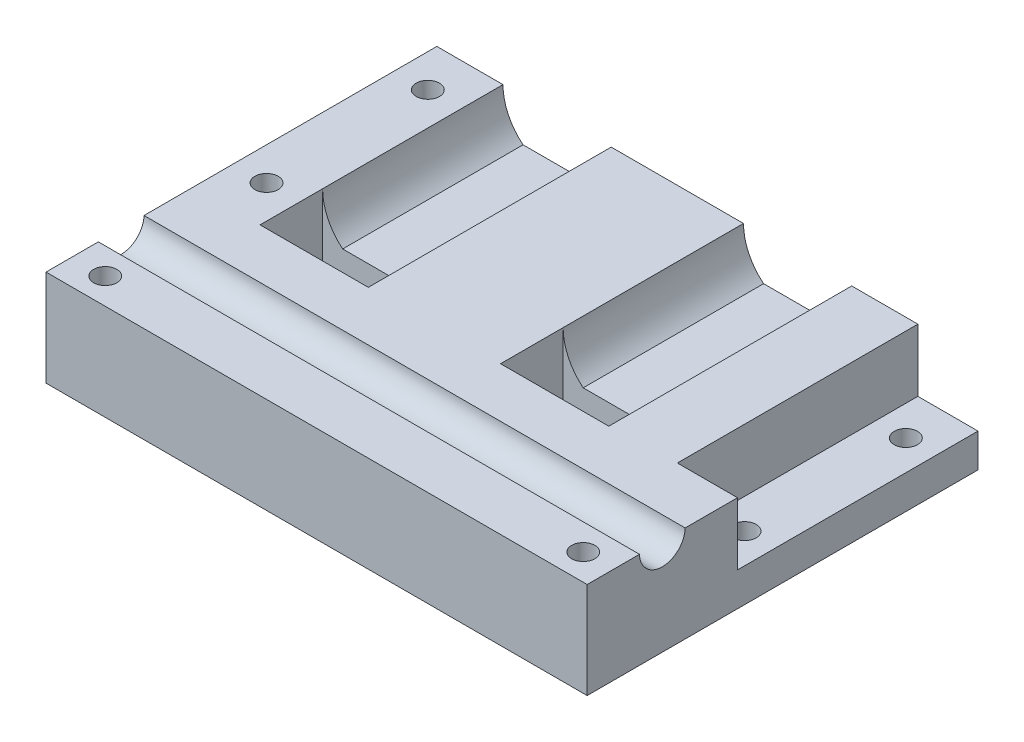
ISO-10303-21;
HEADER;
FILE_DESCRIPTION(('STEP AP214'),'2;1');
FILE_NAME('part.step','',(''),(''),'','','');
FILE_SCHEMA(('AUTOMOTIVE_DESIGN { 1 0 10303 214 1 1 1 1 }'));
ENDSEC;
DATA;
#1=APPLICATION_CONTEXT('core data for automotive mechanical design processes');
#2=APPLICATION_PROTOCOL_DEFINITION('international standard','automotive_design',2000,#1);
#3=PRODUCT_CONTEXT('',#1,'mechanical');
#4=PRODUCT('Part','Part','',(#3));
#5=PRODUCT_RELATED_PRODUCT_CATEGORY('part','',(#4));
#6=PRODUCT_DEFINITION_FORMATION('','',#4);
#7=PRODUCT_DEFINITION_CONTEXT('part definition',#1,'design');
#8=PRODUCT_DEFINITION('design','',#6,#7);
#9=PRODUCT_DEFINITION_SHAPE('','',#8);
#10=(LENGTH_UNIT() NAMED_UNIT(*) SI_UNIT(.MILLI.,.METRE.));
#11=(NAMED_UNIT(*) PLANE_ANGLE_UNIT() SI_UNIT($,.RADIAN.));
#12=(NAMED_UNIT(*) SI_UNIT($,.STERADIAN.) SOLID_ANGLE_UNIT());
#13=UNCERTAINTY_MEASURE_WITH_UNIT(LENGTH_MEASURE(1.E-05),#10,'distance_accuracy_value','');
#14=(GEOMETRIC_REPRESENTATION_CONTEXT(3) GLOBAL_UNCERTAINTY_ASSIGNED_CONTEXT((#13)) GLOBAL_UNIT_ASSIGNED_CONTEXT((#10,
#11,#12)) REPRESENTATION_CONTEXT('',''));
#15=CARTESIAN_POINT('',(0.,0.,0.));
#16=DIRECTION('',(0.,0.,1.));
#17=DIRECTION('',(1.,0.,0.));
#18=AXIS2_PLACEMENT_3D('',#15,#16,#17);
#19=CARTESIAN_POINT('',(-50.8,20.32,38.1));
#20=DIRECTION('',(0.,-1.,0.));
#21=DIRECTION('',(1.,0.,0.));
#22=AXIS2_PLACEMENT_3D('',#19,#20,#21);
#23=PLANE('',#22);
#24=CARTESIAN_POINT('',(57.15,20.32,77.0246643289793));
#25=DIRECTION('',(0.,1.,0.));
#26=DIRECTION('',(0.,0.,1.));
#27=AXIS2_PLACEMENT_3D('',#24,#25,#26);
#28=CIRCLE('',#27,2.45745);
#29=CARTESIAN_POINT('',(57.15,20.32,79.4821143289793));
#30=VERTEX_POINT('',#29);
#31=EDGE_CURVE('E271',#30,#30,#28,.T.);
#32=ORIENTED_EDGE('',*,*,#31,.F.);
#33=EDGE_LOOP('',(#32));
#34=FACE_BOUND('',#33,.T.);
#35=CARTESIAN_POINT('',(-43.815,20.32,77.0246643289793));
#36=DIRECTION('',(0.,1.,0.));
#37=DIRECTION('',(0.,0.,1.));
#38=AXIS2_PLACEMENT_3D('',#35,#36,#37);
#39=CIRCLE('',#38,2.45745);
#40=CARTESIAN_POINT('',(-43.815,20.32,79.4821143289793));
#41=VERTEX_POINT('',#40);
#42=EDGE_CURVE('E262',#41,#41,#39,.T.);
#43=ORIENTED_EDGE('',*,*,#42,.F.);
#44=EDGE_LOOP('',(#43));
#45=FACE_BOUND('',#44,.T.);
#46=DIRECTION('',(0.,0.,1.));
#47=VECTOR('',#46,1.);
#48=CARTESIAN_POINT('',(63.5,20.32,0.));
#49=LINE('',#48,#47);
#50=CARTESIAN_POINT('',(63.5,20.32,71.4993286579585));
#51=VERTEX_POINT('',#50);
#52=CARTESIAN_POINT('',(63.5,20.32,82.55));
#53=VERTEX_POINT('',#52);
#54=EDGE_CURVE('E344',#51,#53,#49,.T.);
#55=ORIENTED_EDGE('',*,*,#54,.F.);
#56=DIRECTION('',(-1.,0.,0.));
#57=VECTOR('',#56,1.);
#58=CARTESIAN_POINT('',(77.1499893040251,20.32,71.4993286579585));
#59=LINE('',#58,#57);
#60=CARTESIAN_POINT('',(-50.8,20.32,71.4993286579585));
#61=VERTEX_POINT('',#60);
#62=EDGE_CURVE('E56',#51,#61,#59,.T.);
#63=ORIENTED_EDGE('',*,*,#62,.T.);
#64=DIRECTION('',(0.,0.,-1.));
#65=VECTOR('',#64,1.);
#66=CARTESIAN_POINT('',(-50.8,20.32,38.1));
#67=LINE('',#66,#65);
#68=CARTESIAN_POINT('',(-50.8,20.32,82.55));
#69=VERTEX_POINT('',#68);
#70=EDGE_CURVE('E211',#69,#61,#67,.T.);
#71=ORIENTED_EDGE('',*,*,#70,.F.);
#72=DIRECTION('',(-1.,0.,0.));
#73=VECTOR('',#72,1.);
#74=CARTESIAN_POINT('',(-50.8,20.32,82.55));
#75=LINE('',#74,#73);
#76=EDGE_CURVE('E373',#53,#69,#75,.T.);
#77=ORIENTED_EDGE('',*,*,#76,.F.);
#78=EDGE_LOOP('',(#55,#63,#71,#77));
#79=FACE_BOUND('',#78,.T.);
#80=ADVANCED_FACE('F39',(#34,#45,#79),#23,.F.);
#81=CARTESIAN_POINT('',(50.8,0.,38.1));
#82=DIRECTION('',(-1.,0.,0.));
#83=DIRECTION('',(0.,-1.,0.));
#84=AXIS2_PLACEMENT_3D('',#81,#82,#83);
#85=PLANE('',#84);
#86=DIRECTION('',(0.,0.,1.));
#87=VECTOR('',#86,1.);
#88=CARTESIAN_POINT('',(50.8,7.11199999999998,0.));
#89=LINE('',#88,#87);
#90=CARTESIAN_POINT('',(50.8,7.11199999999998,0.));
#91=VERTEX_POINT('',#90);
#92=CARTESIAN_POINT('',(50.8,7.11199999999998,50.8));
#93=VERTEX_POINT('',#92);
#94=EDGE_CURVE('E313',#91,#93,#89,.T.);
#95=ORIENTED_EDGE('',*,*,#94,.F.);
#96=DIRECTION('',(0.,1.,0.));
#97=VECTOR('',#96,1.);
#98=CARTESIAN_POINT('',(50.8,0.,0.));
#99=LINE('',#98,#97);
#100=CARTESIAN_POINT('',(50.8,20.32,0.));
#101=VERTEX_POINT('',#100);
#102=EDGE_CURVE('E376',#91,#101,#99,.T.);
#103=ORIENTED_EDGE('',*,*,#102,.T.);
#104=DIRECTION('',(0.,0.,-1.));
#105=VECTOR('',#104,1.);
#106=CARTESIAN_POINT('',(50.8,20.32,38.1));
#107=LINE('',#106,#105);
#108=CARTESIAN_POINT('',(50.8,20.32,50.8));
#109=VERTEX_POINT('',#108);
#110=EDGE_CURVE('E11',#109,#101,#107,.T.);
#111=ORIENTED_EDGE('',*,*,#110,.F.);
#112=DIRECTION('',(0.,1.,0.));
#113=VECTOR('',#112,1.);
#114=CARTESIAN_POINT('',(50.8,0.,50.8));
#115=LINE('',#114,#113);
#116=EDGE_CURVE('E342',#93,#109,#115,.T.);
#117=ORIENTED_EDGE('',*,*,#116,.F.);
#118=EDGE_LOOP('',(#95,#103,#111,#117));
#119=FACE_BOUND('',#118,.T.);
#120=ADVANCED_FACE('F41',(#119),#85,.F.);
#121=CARTESIAN_POINT('',(25.4,20.32,38.1));
#122=DIRECTION('',(0.,0.,-1.));
#123=DIRECTION('',(-1.,0.,0.));
#124=AXIS2_PLACEMENT_3D('',#121,#122,#123);
#125=CYLINDRICAL_SURFACE('',#124,11.43);
#126=CARTESIAN_POINT('',(25.4,20.32,0.));
#127=DIRECTION('',(0.,0.,-1.));
#128=DIRECTION('',(1.,0.,0.));
#129=AXIS2_PLACEMENT_3D('',#126,#127,#128);
#130=CIRCLE('',#129,11.43);
#131=CARTESIAN_POINT('',(36.83,20.32,0.));
#132=VERTEX_POINT('',#131);
#133=CARTESIAN_POINT('',(32.5842048968553,11.43,0.));
#134=VERTEX_POINT('',#133);
#135=EDGE_CURVE('E394',#132,#134,#130,.T.);
#136=ORIENTED_EDGE('',*,*,#135,.T.);
#137=DIRECTION('',(0.,0.,-1.));
#138=VECTOR('',#137,1.);
#139=CARTESIAN_POINT('',(32.5842048968553,11.43,38.1));
#140=LINE('',#139,#138);
#141=CARTESIAN_POINT('',(32.5842048968553,11.43,38.1));
#142=VERTEX_POINT('',#141);
#143=EDGE_CURVE('E243',#142,#134,#140,.T.);
#144=ORIENTED_EDGE('',*,*,#143,.F.);
#145=CARTESIAN_POINT('',(25.4,20.32,38.1));
#146=DIRECTION('',(0.,0.,-1.));
#147=DIRECTION('',(1.,0.,0.));
#148=AXIS2_PLACEMENT_3D('',#145,#146,#147);
#149=CIRCLE('',#148,11.43);
#150=CARTESIAN_POINT('',(36.83,20.32,38.1));
#151=VERTEX_POINT('',#150);
#152=EDGE_CURVE('E377',#151,#142,#149,.T.);
#153=ORIENTED_EDGE('',*,*,#152,.F.);
#154=DIRECTION('',(0.,0.,-1.));
#155=VECTOR('',#154,1.);
#156=CARTESIAN_POINT('',(36.83,20.32,38.1));
#157=LINE('',#156,#155);
#158=EDGE_CURVE('E48',#151,#132,#157,.T.);
#159=ORIENTED_EDGE('',*,*,#158,.T.);
#160=EDGE_LOOP('',(#136,#144,#153,#159));
#161=FACE_BOUND('',#160,.T.);
#162=ADVANCED_FACE('F438',(#161),#125,.F.);
#163=CARTESIAN_POINT('',(32.5842048968553,11.43,38.1));
#164=DIRECTION('',(0.,-1.,0.));
#165=DIRECTION('',(1.,0.,0.));
#166=AXIS2_PLACEMENT_3D('',#163,#164,#165);
#167=PLANE('',#166);
#168=DIRECTION('',(-1.,0.,0.));
#169=VECTOR('',#168,1.);
#170=CARTESIAN_POINT('',(32.5842048968553,11.43,0.));
#171=LINE('',#170,#169);
#172=CARTESIAN_POINT('',(18.2157951031447,11.43,0.));
#173=VERTEX_POINT('',#172);
#174=EDGE_CURVE('E396',#134,#173,#171,.T.);
#175=ORIENTED_EDGE('',*,*,#174,.T.);
#176=DIRECTION('',(0.,0.,-1.));
#177=VECTOR('',#176,1.);
#178=CARTESIAN_POINT('',(18.2157951031447,11.43,38.1));
#179=LINE('',#178,#177);
#180=CARTESIAN_POINT('',(18.2157951031447,11.43,38.1));
#181=VERTEX_POINT('',#180);
#182=EDGE_CURVE('E240',#181,#173,#179,.T.);
#183=ORIENTED_EDGE('',*,*,#182,.F.);
#184=DIRECTION('',(-1.,0.,0.));
#185=VECTOR('',#184,1.);
#186=CARTESIAN_POINT('',(32.5842048968553,11.43,38.1));
#187=LINE('',#186,#185);
#188=EDGE_CURVE('E379',#142,#181,#187,.T.);
#189=ORIENTED_EDGE('',*,*,#188,.F.);
#190=ORIENTED_EDGE('',*,*,#143,.T.);
#191=EDGE_LOOP('',(#175,#183,#189,#190));
#192=FACE_BOUND('',#191,.T.);
#193=ADVANCED_FACE('F442',(#192),#167,.F.);
#194=CARTESIAN_POINT('',(25.4,20.32,38.1));
#195=DIRECTION('',(0.,0.,-1.));
#196=DIRECTION('',(-1.,0.,0.));
#197=AXIS2_PLACEMENT_3D('',#194,#195,#196);
#198=CYLINDRICAL_SURFACE('',#197,11.43);
#199=CARTESIAN_POINT('',(25.4,20.32,0.));
#200=DIRECTION('',(0.,0.,-1.));
#201=DIRECTION('',(1.,0.,0.));
#202=AXIS2_PLACEMENT_3D('',#199,#200,#201);
#203=CIRCLE('',#202,11.43);
#204=CARTESIAN_POINT('',(13.97,20.32,0.));
#205=VERTEX_POINT('',#204);
#206=EDGE_CURVE('E398',#173,#205,#203,.T.);
#207=ORIENTED_EDGE('',*,*,#206,.T.);
#208=DIRECTION('',(0.,0.,-1.));
#209=VECTOR('',#208,1.);
#210=CARTESIAN_POINT('',(13.97,20.32,38.1));
#211=LINE('',#210,#209);
#212=CARTESIAN_POINT('',(13.97,20.32,38.1));
#213=VERTEX_POINT('',#212);
#214=EDGE_CURVE('E237',#213,#205,#211,.T.);
#215=ORIENTED_EDGE('',*,*,#214,.F.);
#216=CARTESIAN_POINT('',(25.4,20.32,38.1));
#217=DIRECTION('',(0.,0.,-1.));
#218=DIRECTION('',(1.,0.,0.));
#219=AXIS2_PLACEMENT_3D('',#216,#217,#218);
#220=CIRCLE('',#219,11.43);
#221=EDGE_CURVE('E382',#181,#213,#220,.T.);
#222=ORIENTED_EDGE('',*,*,#221,.F.);
#223=ORIENTED_EDGE('',*,*,#182,.T.);
#224=EDGE_LOOP('',(#207,#215,#222,#223));
#225=FACE_BOUND('',#224,.T.);
#226=ADVANCED_FACE('F810',(#225),#198,.F.);
#227=CARTESIAN_POINT('',(-25.4,20.32,38.1));
#228=DIRECTION('',(0.,0.,-1.));
#229=DIRECTION('',(-1.,0.,0.));
#230=AXIS2_PLACEMENT_3D('',#227,#228,#229);
#231=CYLINDRICAL_SURFACE('',#230,11.43);
#232=CARTESIAN_POINT('',(-25.4,20.32,0.));
#233=DIRECTION('',(0.,0.,-1.));
#234=DIRECTION('',(-1.,0.,0.));
#235=AXIS2_PLACEMENT_3D('',#232,#233,#234);
#236=CIRCLE('',#235,11.43);
#237=CARTESIAN_POINT('',(-13.97,20.32,0.));
#238=VERTEX_POINT('',#237);
#239=CARTESIAN_POINT('',(-18.2157951031447,11.43,0.));
#240=VERTEX_POINT('',#239);
#241=EDGE_CURVE('E402',#238,#240,#236,.T.);
#242=ORIENTED_EDGE('',*,*,#241,.T.);
#243=DIRECTION('',(0.,0.,-1.));
#244=VECTOR('',#243,1.);
#245=CARTESIAN_POINT('',(-18.2157951031447,11.43,38.1));
#246=LINE('',#245,#244);
#247=CARTESIAN_POINT('',(-18.2157951031447,11.43,38.1));
#248=VERTEX_POINT('',#247);
#249=EDGE_CURVE('E231',#248,#240,#246,.T.);
#250=ORIENTED_EDGE('',*,*,#249,.F.);
#251=CARTESIAN_POINT('',(-25.4,20.32,38.1));
#252=DIRECTION('',(0.,0.,-1.));
#253=DIRECTION('',(-1.,0.,0.));
#254=AXIS2_PLACEMENT_3D('',#251,#252,#253);
#255=CIRCLE('',#254,11.43);
#256=CARTESIAN_POINT('',(-13.97,20.32,38.1));
#257=VERTEX_POINT('',#256);
#258=EDGE_CURVE('E385',#257,#248,#255,.T.);
#259=ORIENTED_EDGE('',*,*,#258,.F.);
#260=DIRECTION('',(0.,0.,-1.));
#261=VECTOR('',#260,1.);
#262=CARTESIAN_POINT('',(-13.97,20.32,38.1));
#263=LINE('',#262,#261);
#264=EDGE_CURVE('E234',#257,#238,#263,.T.);
#265=ORIENTED_EDGE('',*,*,#264,.T.);
#266=EDGE_LOOP('',(#242,#250,#259,#265));
#267=FACE_BOUND('',#266,.T.);
#268=ADVANCED_FACE('F522',(#267),#231,.F.);
#269=CARTESIAN_POINT('',(-32.5842048968553,11.43,38.1));
#270=DIRECTION('',(0.,-1.,0.));
#271=DIRECTION('',(1.,0.,0.));
#272=AXIS2_PLACEMENT_3D('',#269,#270,#271);
#273=PLANE('',#272);
#274=DIRECTION('',(-1.,0.,0.));
#275=VECTOR('',#274,1.);
#276=CARTESIAN_POINT('',(-32.5842048968553,11.43,0.));
#277=LINE('',#276,#275);
#278=CARTESIAN_POINT('',(-32.5842048968553,11.43,0.));
#279=VERTEX_POINT('',#278);
#280=EDGE_CURVE('E404',#240,#279,#277,.T.);
#281=ORIENTED_EDGE('',*,*,#280,.T.);
#282=DIRECTION('',(0.,0.,-1.));
#283=VECTOR('',#282,1.);
#284=CARTESIAN_POINT('',(-32.5842048968553,11.43,38.1));
#285=LINE('',#284,#283);
#286=CARTESIAN_POINT('',(-32.5842048968553,11.43,38.1));
#287=VERTEX_POINT('',#286);
#288=EDGE_CURVE('E228',#287,#279,#285,.T.);
#289=ORIENTED_EDGE('',*,*,#288,.F.);
#290=DIRECTION('',(-1.,0.,0.));
#291=VECTOR('',#290,1.);
#292=CARTESIAN_POINT('',(-32.5842048968553,11.43,38.1));
#293=LINE('',#292,#291);
#294=EDGE_CURVE('E387',#248,#287,#293,.T.);
#295=ORIENTED_EDGE('',*,*,#294,.F.);
#296=ORIENTED_EDGE('',*,*,#249,.T.);
#297=EDGE_LOOP('',(#281,#289,#295,#296));
#298=FACE_BOUND('',#297,.T.);
#299=ADVANCED_FACE('F490',(#298),#273,.F.);
#300=CARTESIAN_POINT('',(-25.4,20.32,38.1));
#301=DIRECTION('',(0.,0.,-1.));
#302=DIRECTION('',(-1.,0.,0.));
#303=AXIS2_PLACEMENT_3D('',#300,#301,#302);
#304=CYLINDRICAL_SURFACE('',#303,11.43);
#305=CARTESIAN_POINT('',(-25.4,20.32,0.));
#306=DIRECTION('',(0.,0.,-1.));
#307=DIRECTION('',(-1.,0.,0.));
#308=AXIS2_PLACEMENT_3D('',#305,#306,#307);
#309=CIRCLE('',#308,11.43);
#310=CARTESIAN_POINT('',(-36.83,20.32,0.));
#311=VERTEX_POINT('',#310);
#312=EDGE_CURVE('E406',#279,#311,#309,.T.);
#313=ORIENTED_EDGE('',*,*,#312,.T.);
#314=DIRECTION('',(0.,0.,-1.));
#315=VECTOR('',#314,1.);
#316=CARTESIAN_POINT('',(-36.83,20.32,38.1));
#317=LINE('',#316,#315);
#318=CARTESIAN_POINT('',(-36.83,20.32,38.1));
#319=VERTEX_POINT('',#318);
#320=EDGE_CURVE('E221',#319,#311,#317,.T.);
#321=ORIENTED_EDGE('',*,*,#320,.F.);
#322=CARTESIAN_POINT('',(-25.4,20.32,38.1));
#323=DIRECTION('',(0.,0.,-1.));
#324=DIRECTION('',(-1.,0.,0.));
#325=AXIS2_PLACEMENT_3D('',#322,#323,#324);
#326=CIRCLE('',#325,11.43);
#327=EDGE_CURVE('E223',#287,#319,#326,.T.);
#328=ORIENTED_EDGE('',*,*,#327,.F.);
#329=ORIENTED_EDGE('',*,*,#288,.T.);
#330=EDGE_LOOP('',(#313,#321,#328,#329));
#331=FACE_BOUND('',#330,.T.);
#332=ADVANCED_FACE('F485',(#331),#304,.F.);
#333=CARTESIAN_POINT('',(-43.815,20.32,42.9573321644896));
#334=DIRECTION('',(0.,1.,0.));
#335=DIRECTION('',(0.,0.,1.));
#336=AXIS2_PLACEMENT_3D('',#333,#334,#335);
#337=CIRCLE('',#336,2.45745);
#338=CARTESIAN_POINT('',(-43.815,20.32,45.4147821644896));
#339=VERTEX_POINT('',#338);
#340=EDGE_CURVE('E253',#339,#339,#337,.T.);
#341=ORIENTED_EDGE('',*,*,#340,.F.);
#342=EDGE_LOOP('',(#341));
#343=FACE_BOUND('',#342,.T.);
#344=CARTESIAN_POINT('',(-43.815,20.32,8.89));
#345=DIRECTION('',(0.,1.,0.));
#346=DIRECTION('',(0.,0.,1.));
#347=AXIS2_PLACEMENT_3D('',#344,#345,#346);
#348=CIRCLE('',#347,2.45745);
#349=CARTESIAN_POINT('',(-43.815,20.32,11.34745));
#350=VERTEX_POINT('',#349);
#351=EDGE_CURVE('E281',#350,#350,#348,.T.);
#352=ORIENTED_EDGE('',*,*,#351,.F.);
#353=EDGE_LOOP('',(#352));
#354=FACE_BOUND('',#353,.T.);
#355=CARTESIAN_POINT('',(-50.8,20.32,61.8506713420415));
#356=VERTEX_POINT('',#355);
#357=CARTESIAN_POINT('',(-50.8,20.32,0.));
#358=VERTEX_POINT('',#357);
#359=EDGE_CURVE('E208',#356,#358,#67,.T.);
#360=ORIENTED_EDGE('',*,*,#359,.F.);
#361=DIRECTION('',(-1.,0.,0.));
#362=VECTOR('',#361,1.);
#363=CARTESIAN_POINT('',(77.1499893040251,20.32,61.8506713420415));
#364=LINE('',#363,#362);
#365=CARTESIAN_POINT('',(63.5,20.32,61.8506713420415));
#366=VERTEX_POINT('',#365);
#367=EDGE_CURVE('E195',#356,#366,#364,.F.);
#368=ORIENTED_EDGE('',*,*,#367,.T.);
#369=CARTESIAN_POINT('',(63.5,20.32,50.8));
#370=VERTEX_POINT('',#369);
#371=EDGE_CURVE('E345',#370,#366,#49,.T.);
#372=ORIENTED_EDGE('',*,*,#371,.F.);
#373=DIRECTION('',(-1.,0.,0.));
#374=VECTOR('',#373,1.);
#375=CARTESIAN_POINT('',(63.5,20.32,50.8));
#376=LINE('',#375,#374);
#377=EDGE_CURVE('E362',#370,#109,#376,.T.);
#378=ORIENTED_EDGE('',*,*,#377,.T.);
#379=ORIENTED_EDGE('',*,*,#110,.T.);
#380=DIRECTION('',(-1.,0.,0.));
#381=VECTOR('',#380,1.);
#382=CARTESIAN_POINT('',(50.8,20.32,0.));
#383=LINE('',#382,#381);
#384=EDGE_CURVE('E392',#101,#132,#383,.T.);
#385=ORIENTED_EDGE('',*,*,#384,.T.);
#386=ORIENTED_EDGE('',*,*,#158,.F.);
#387=DIRECTION('',(0.,0.,-1.));
#388=VECTOR('',#387,1.);
#389=CARTESIAN_POINT('',(36.83,20.32,38.1));
#390=LINE('',#389,#388);
#391=CARTESIAN_POINT('',(36.83,20.32,51.308));
#392=VERTEX_POINT('',#391);
#393=EDGE_CURVE('E327',#392,#151,#390,.T.);
#394=ORIENTED_EDGE('',*,*,#393,.F.);
#395=DIRECTION('',(1.,0.,0.));
#396=VECTOR('',#395,1.);
#397=CARTESIAN_POINT('',(36.83,20.32,51.308));
#398=LINE('',#397,#396);
#399=CARTESIAN_POINT('',(13.97,20.32,51.308));
#400=VERTEX_POINT('',#399);
#401=EDGE_CURVE('E324',#400,#392,#398,.T.);
#402=ORIENTED_EDGE('',*,*,#401,.F.);
#403=DIRECTION('',(0.,0.,1.));
#404=VECTOR('',#403,1.);
#405=CARTESIAN_POINT('',(13.97,20.32,38.1));
#406=LINE('',#405,#404);
#407=EDGE_CURVE('E287',#213,#400,#406,.T.);
#408=ORIENTED_EDGE('',*,*,#407,.F.);
#409=ORIENTED_EDGE('',*,*,#214,.T.);
#410=DIRECTION('',(-1.,0.,0.));
#411=VECTOR('',#410,1.);
#412=CARTESIAN_POINT('',(13.97,20.32,0.));
#413=LINE('',#412,#411);
#414=EDGE_CURVE('E400',#205,#238,#413,.T.);
#415=ORIENTED_EDGE('',*,*,#414,.T.);
#416=ORIENTED_EDGE('',*,*,#264,.F.);
#417=DIRECTION('',(0.,0.,-1.));
#418=VECTOR('',#417,1.);
#419=CARTESIAN_POINT('',(-13.97,20.32,38.1));
#420=LINE('',#419,#418);
#421=CARTESIAN_POINT('',(-13.97,20.32,51.308));
#422=VERTEX_POINT('',#421);
#423=EDGE_CURVE('E302',#422,#257,#420,.T.);
#424=ORIENTED_EDGE('',*,*,#423,.F.);
#425=DIRECTION('',(1.,0.,0.));
#426=VECTOR('',#425,1.);
#427=CARTESIAN_POINT('',(-36.83,20.32,51.308));
#428=LINE('',#427,#426);
#429=CARTESIAN_POINT('',(-36.83,20.32,51.308));
#430=VERTEX_POINT('',#429);
#431=EDGE_CURVE('E298',#430,#422,#428,.T.);
#432=ORIENTED_EDGE('',*,*,#431,.F.);
#433=DIRECTION('',(0.,0.,1.));
#434=VECTOR('',#433,1.);
#435=CARTESIAN_POINT('',(-36.83,20.32,38.1));
#436=LINE('',#435,#434);
#437=EDGE_CURVE('E64',#319,#430,#436,.T.);
#438=ORIENTED_EDGE('',*,*,#437,.F.);
#439=ORIENTED_EDGE('',*,*,#320,.T.);
#440=DIRECTION('',(-1.,0.,0.));
#441=VECTOR('',#440,1.);
#442=CARTESIAN_POINT('',(-50.8,20.32,0.));
#443=LINE('',#442,#441);
#444=EDGE_CURVE('E217',#311,#358,#443,.T.);
#445=ORIENTED_EDGE('',*,*,#444,.T.);
#446=EDGE_LOOP('',(#360,#368,#372,#378,#379,#385,#386,#394,#402,#408,#409,#415,#416,#424,#432,
#438,#439,#445));
#447=FACE_BOUND('',#446,.T.);
#448=ADVANCED_FACE('F214',(#343,#354,#447),#23,.F.);
#449=CARTESIAN_POINT('',(-50.8,0.,38.1));
#450=DIRECTION('',(1.,0.,0.));
#451=DIRECTION('',(0.,1.,0.));
#452=AXIS2_PLACEMENT_3D('',#449,#450,#451);
#453=PLANE('',#452);
#454=ORIENTED_EDGE('',*,*,#70,.T.);
#455=CARTESIAN_POINT('',(-50.8,20.447,66.675));
#456=DIRECTION('',(-1.,0.,0.));
#457=DIRECTION('',(0.,0.,1.));
#458=AXIS2_PLACEMENT_3D('',#455,#456,#457);
#459=CIRCLE('',#458,4.826);
#460=EDGE_CURVE('E198',#356,#61,#459,.T.);
#461=ORIENTED_EDGE('',*,*,#460,.F.);
#462=ORIENTED_EDGE('',*,*,#359,.T.);
#463=DIRECTION('',(0.,-1.,0.));
#464=VECTOR('',#463,1.);
#465=CARTESIAN_POINT('',(-50.8,0.,0.));
#466=LINE('',#465,#464);
#467=CARTESIAN_POINT('',(-50.8,0.,0.));
#468=VERTEX_POINT('',#467);
#469=EDGE_CURVE('E409',#358,#468,#466,.T.);
#470=ORIENTED_EDGE('',*,*,#469,.T.);
#471=DIRECTION('',(0.,0.,-1.));
#472=VECTOR('',#471,1.);
#473=CARTESIAN_POINT('',(-50.8,0.,38.1));
#474=LINE('',#473,#472);
#475=CARTESIAN_POINT('',(-50.8,0.,82.55));
#476=VERTEX_POINT('',#475);
#477=EDGE_CURVE('E219',#476,#468,#474,.T.);
#478=ORIENTED_EDGE('',*,*,#477,.F.);
#479=DIRECTION('',(0.,-1.,0.));
#480=VECTOR('',#479,1.);
#481=CARTESIAN_POINT('',(-50.8,20.32,82.55));
#482=LINE('',#481,#480);
#483=EDGE_CURVE('E368',#69,#476,#482,.T.);
#484=ORIENTED_EDGE('',*,*,#483,.F.);
#485=EDGE_LOOP('',(#454,#461,#462,#470,#478,#484));
#486=FACE_BOUND('',#485,.T.);
#487=ADVANCED_FACE('F207',(#486),#453,.F.);
#488=CARTESIAN_POINT('',(-50.8,0.,38.1));
#489=DIRECTION('',(0.,1.,0.));
#490=DIRECTION('',(0.,0.,1.));
#491=AXIS2_PLACEMENT_3D('',#488,#489,#490);
#492=PLANE('',#491);
#493=CARTESIAN_POINT('',(57.15,0.,77.0246643289793));
#494=DIRECTION('',(0.,1.,0.));
#495=DIRECTION('',(0.,0.,1.));
#496=AXIS2_PLACEMENT_3D('',#493,#494,#495);
#497=CIRCLE('',#496,2.45745);
#498=CARTESIAN_POINT('',(57.15,0.,79.4821143289793));
#499=VERTEX_POINT('',#498);
#500=EDGE_CURVE('E266',#499,#499,#497,.T.);
#501=ORIENTED_EDGE('',*,*,#500,.T.);
#502=EDGE_LOOP('',(#501));
#503=FACE_BOUND('',#502,.T.);
#504=CARTESIAN_POINT('',(-43.815,0.,77.0246643289793));
#505=DIRECTION('',(0.,1.,0.));
#506=DIRECTION('',(0.,0.,1.));
#507=AXIS2_PLACEMENT_3D('',#504,#505,#506);
#508=CIRCLE('',#507,2.45745);
#509=CARTESIAN_POINT('',(-43.815,0.,79.4821143289793));
#510=VERTEX_POINT('',#509);
#511=EDGE_CURVE('E43',#510,#510,#508,.T.);
#512=ORIENTED_EDGE('',*,*,#511,.T.);
#513=EDGE_LOOP('',(#512));
#514=FACE_BOUND('',#513,.T.);
#515=CARTESIAN_POINT('',(57.15,0.,42.9573321644896));
#516=DIRECTION('',(0.,1.,0.));
#517=DIRECTION('',(0.,0.,1.));
#518=AXIS2_PLACEMENT_3D('',#515,#516,#517);
#519=CIRCLE('',#518,2.45745);
#520=CARTESIAN_POINT('',(57.15,0.,45.4147821644896));
#521=VERTEX_POINT('',#520);
#522=EDGE_CURVE('E254',#521,#521,#519,.T.);
#523=ORIENTED_EDGE('',*,*,#522,.T.);
#524=EDGE_LOOP('',(#523));
#525=FACE_BOUND('',#524,.T.);
#526=CARTESIAN_POINT('',(-43.815,0.,42.9573321644896));
#527=DIRECTION('',(0.,1.,0.));
#528=DIRECTION('',(0.,0.,1.));
#529=AXIS2_PLACEMENT_3D('',#526,#527,#528);
#530=CIRCLE('',#529,2.45745);
#531=CARTESIAN_POINT('',(-43.815,0.,45.4147821644896));
#532=VERTEX_POINT('',#531);
#533=EDGE_CURVE('E251',#532,#532,#530,.T.);
#534=ORIENTED_EDGE('',*,*,#533,.T.);
#535=EDGE_LOOP('',(#534));
#536=FACE_BOUND('',#535,.T.);
#537=CARTESIAN_POINT('',(57.15,0.,8.89));
#538=DIRECTION('',(0.,1.,0.));
#539=DIRECTION('',(0.,0.,1.));
#540=AXIS2_PLACEMENT_3D('',#537,#538,#539);
#541=CIRCLE('',#540,2.45745);
#542=CARTESIAN_POINT('',(57.15,0.,11.34745));
#543=VERTEX_POINT('',#542);
#544=EDGE_CURVE('E248',#543,#543,#541,.T.);
#545=ORIENTED_EDGE('',*,*,#544,.T.);
#546=EDGE_LOOP('',(#545));
#547=FACE_BOUND('',#546,.T.);
#548=CARTESIAN_POINT('',(-43.815,0.,8.89));
#549=DIRECTION('',(0.,1.,0.));
#550=DIRECTION('',(0.,0.,1.));
#551=AXIS2_PLACEMENT_3D('',#548,#549,#550);
#552=CIRCLE('',#551,2.45745);
#553=CARTESIAN_POINT('',(-43.815,0.,11.34745));
#554=VERTEX_POINT('',#553);
#555=EDGE_CURVE('E284',#554,#554,#552,.T.);
#556=ORIENTED_EDGE('',*,*,#555,.T.);
#557=EDGE_LOOP('',(#556));
#558=FACE_BOUND('',#557,.T.);
#559=DIRECTION('',(1.,0.,0.));
#560=VECTOR('',#559,1.);
#561=CARTESIAN_POINT('',(-36.83,0.,38.1));
#562=LINE('',#561,#560);
#563=CARTESIAN_POINT('',(-36.83,0.,38.1));
#564=VERTEX_POINT('',#563);
#565=CARTESIAN_POINT('',(-13.97,0.,38.1));
#566=VERTEX_POINT('',#565);
#567=EDGE_CURVE('E291',#564,#566,#562,.T.);
#568=ORIENTED_EDGE('',*,*,#567,.F.);
#569=DIRECTION('',(0.,0.,-1.));
#570=VECTOR('',#569,1.);
#571=CARTESIAN_POINT('',(-36.83,0.,38.1));
#572=LINE('',#571,#570);
#573=CARTESIAN_POINT('',(-36.83,0.,51.308));
#574=VERTEX_POINT('',#573);
#575=EDGE_CURVE('E294',#574,#564,#572,.T.);
#576=ORIENTED_EDGE('',*,*,#575,.F.);
#577=DIRECTION('',(-1.,0.,0.));
#578=VECTOR('',#577,1.);
#579=CARTESIAN_POINT('',(-36.83,0.,51.308));
#580=LINE('',#579,#578);
#581=CARTESIAN_POINT('',(-13.97,0.,51.308));
#582=VERTEX_POINT('',#581);
#583=EDGE_CURVE('E296',#582,#574,#580,.T.);
#584=ORIENTED_EDGE('',*,*,#583,.F.);
#585=DIRECTION('',(0.,0.,1.));
#586=VECTOR('',#585,1.);
#587=CARTESIAN_POINT('',(-13.97,0.,38.1));
#588=LINE('',#587,#586);
#589=EDGE_CURVE('E288',#566,#582,#588,.T.);
#590=ORIENTED_EDGE('',*,*,#589,.F.);
#591=EDGE_LOOP('',(#568,#576,#584,#590));
#592=FACE_BOUND('',#591,.T.);
#593=DIRECTION('',(0.,0.,1.));
#594=VECTOR('',#593,1.);
#595=CARTESIAN_POINT('',(36.83,0.,38.1));
#596=LINE('',#595,#594);
#597=CARTESIAN_POINT('',(36.83,0.,38.1));
#598=VERTEX_POINT('',#597);
#599=CARTESIAN_POINT('',(36.83,0.,51.308));
#600=VERTEX_POINT('',#599);
#601=EDGE_CURVE('E317',#598,#600,#596,.T.);
#602=ORIENTED_EDGE('',*,*,#601,.F.);
#603=DIRECTION('',(1.,0.,0.));
#604=VECTOR('',#603,1.);
#605=CARTESIAN_POINT('',(36.83,0.,38.1));
#606=LINE('',#605,#604);
#607=CARTESIAN_POINT('',(13.97,0.,38.1));
#608=VERTEX_POINT('',#607);
#609=EDGE_CURVE('E320',#608,#598,#606,.T.);
#610=ORIENTED_EDGE('',*,*,#609,.F.);
#611=DIRECTION('',(0.,0.,-1.));
#612=VECTOR('',#611,1.);
#613=CARTESIAN_POINT('',(13.97,0.,38.1));
#614=LINE('',#613,#612);
#615=CARTESIAN_POINT('',(13.97,0.,51.308));
#616=VERTEX_POINT('',#615);
#617=EDGE_CURVE('E299',#616,#608,#614,.T.);
#618=ORIENTED_EDGE('',*,*,#617,.F.);
#619=DIRECTION('',(-1.,0.,0.));
#620=VECTOR('',#619,1.);
#621=CARTESIAN_POINT('',(36.83,0.,51.308));
#622=LINE('',#621,#620);
#623=EDGE_CURVE('E314',#600,#616,#622,.T.);
#624=ORIENTED_EDGE('',*,*,#623,.F.);
#625=EDGE_LOOP('',(#602,#610,#618,#624));
#626=FACE_BOUND('',#625,.T.);
#627=DIRECTION('',(1.,0.,0.));
#628=VECTOR('',#627,1.);
#629=CARTESIAN_POINT('',(-50.8,0.,0.));
#630=LINE('',#629,#628);
#631=CARTESIAN_POINT('',(63.5,0.,0.));
#632=VERTEX_POINT('',#631);
#633=EDGE_CURVE('E380',#468,#632,#630,.T.);
#634=ORIENTED_EDGE('',*,*,#633,.T.);
#635=DIRECTION('',(0.,0.,-1.));
#636=VECTOR('',#635,1.);
#637=CARTESIAN_POINT('',(63.5,0.,0.));
#638=LINE('',#637,#636);
#639=CARTESIAN_POINT('',(63.5,0.,82.55));
#640=VERTEX_POINT('',#639);
#641=EDGE_CURVE('E350',#640,#632,#638,.T.);
#642=ORIENTED_EDGE('',*,*,#641,.F.);
#643=DIRECTION('',(1.,0.,0.));
#644=VECTOR('',#643,1.);
#645=CARTESIAN_POINT('',(-50.8,0.,82.55));
#646=LINE('',#645,#644);
#647=EDGE_CURVE('E371',#476,#640,#646,.T.);
#648=ORIENTED_EDGE('',*,*,#647,.F.);
#649=ORIENTED_EDGE('',*,*,#477,.T.);
#650=EDGE_LOOP('',(#634,#642,#648,#649));
#651=FACE_BOUND('',#650,.T.);
#652=ADVANCED_FACE('F413',(#503,#514,#525,#536,#547,#558,#592,#626,#651),#492,.F.);
#653=CARTESIAN_POINT('',(25.4,20.32,0.));
#654=DIRECTION('',(0.,0.,1.));
#655=DIRECTION('',(1.,0.,0.));
#656=AXIS2_PLACEMENT_3D('',#653,#654,#655);
#657=PLANE('',#656);
#658=ORIENTED_EDGE('',*,*,#102,.F.);
#659=DIRECTION('',(-1.,0.,0.));
#660=VECTOR('',#659,1.);
#661=CARTESIAN_POINT('',(63.5,7.11199999999998,0.));
#662=LINE('',#661,#660);
#663=CARTESIAN_POINT('',(63.5,7.11199999999998,0.));
#664=VERTEX_POINT('',#663);
#665=EDGE_CURVE('E355',#664,#91,#662,.T.);
#666=ORIENTED_EDGE('',*,*,#665,.F.);
#667=DIRECTION('',(0.,1.,0.));
#668=VECTOR('',#667,1.);
#669=CARTESIAN_POINT('',(63.5,0.,0.));
#670=LINE('',#669,#668);
#671=EDGE_CURVE('E353',#632,#664,#670,.T.);
#672=ORIENTED_EDGE('',*,*,#671,.F.);
#673=ORIENTED_EDGE('',*,*,#633,.F.);
#674=ORIENTED_EDGE('',*,*,#469,.F.);
#675=ORIENTED_EDGE('',*,*,#444,.F.);
#676=ORIENTED_EDGE('',*,*,#312,.F.);
#677=ORIENTED_EDGE('',*,*,#280,.F.);
#678=ORIENTED_EDGE('',*,*,#241,.F.);
#679=ORIENTED_EDGE('',*,*,#414,.F.);
#680=ORIENTED_EDGE('',*,*,#206,.F.);
#681=ORIENTED_EDGE('',*,*,#174,.F.);
#682=ORIENTED_EDGE('',*,*,#135,.F.);
#683=ORIENTED_EDGE('',*,*,#384,.F.);
#684=EDGE_LOOP('',(#658,#666,#672,#673,#674,#675,#676,#677,#678,#679,#680,#681,#682,#683));
#685=FACE_BOUND('',#684,.T.);
#686=ADVANCED_FACE('F422',(#685),#657,.F.);
#687=CARTESIAN_POINT('',(0.,0.,82.55));
#688=DIRECTION('',(0.,0.,1.));
#689=DIRECTION('',(1.,0.,0.));
#690=AXIS2_PLACEMENT_3D('',#687,#688,#689);
#691=PLANE('',#690);
#692=ORIENTED_EDGE('',*,*,#483,.T.);
#693=ORIENTED_EDGE('',*,*,#647,.T.);
#694=DIRECTION('',(0.,-1.,0.));
#695=VECTOR('',#694,1.);
#696=CARTESIAN_POINT('',(63.5,0.,82.55));
#697=LINE('',#696,#695);
#698=EDGE_CURVE('E347',#53,#640,#697,.T.);
#699=ORIENTED_EDGE('',*,*,#698,.F.);
#700=ORIENTED_EDGE('',*,*,#76,.T.);
#701=EDGE_LOOP('',(#692,#693,#699,#700));
#702=FACE_BOUND('',#701,.T.);
#703=ADVANCED_FACE('F472',(#702),#691,.T.);
#704=CARTESIAN_POINT('',(63.5,7.11199999999998,0.));
#705=DIRECTION('',(0.,-1.,0.));
#706=DIRECTION('',(1.,0.,0.));
#707=AXIS2_PLACEMENT_3D('',#704,#705,#706);
#708=PLANE('',#707);
#709=CARTESIAN_POINT('',(57.15,7.11199999999998,42.9573321644896));
#710=DIRECTION('',(0.,-1.,0.));
#711=DIRECTION('',(1.,0.,0.));
#712=AXIS2_PLACEMENT_3D('',#709,#710,#711);
#713=CIRCLE('',#712,2.45745);
#714=CARTESIAN_POINT('',(59.60745,7.11199999999998,42.9573321644896));
#715=VERTEX_POINT('',#714);
#716=EDGE_CURVE('E256',#715,#715,#713,.T.);
#717=ORIENTED_EDGE('',*,*,#716,.T.);
#718=EDGE_LOOP('',(#717));
#719=FACE_BOUND('',#718,.T.);
#720=CARTESIAN_POINT('',(57.15,7.11199999999998,8.89));
#721=DIRECTION('',(0.,-1.,0.));
#722=DIRECTION('',(1.,0.,0.));
#723=AXIS2_PLACEMENT_3D('',#720,#721,#722);
#724=CIRCLE('',#723,2.45745);
#725=CARTESIAN_POINT('',(59.60745,7.11199999999998,8.89));
#726=VERTEX_POINT('',#725);
#727=EDGE_CURVE('E212',#726,#726,#724,.T.);
#728=ORIENTED_EDGE('',*,*,#727,.T.);
#729=EDGE_LOOP('',(#728));
#730=FACE_BOUND('',#729,.T.);
#731=ORIENTED_EDGE('',*,*,#94,.T.);
#732=DIRECTION('',(-1.,0.,0.));
#733=VECTOR('',#732,1.);
#734=CARTESIAN_POINT('',(63.5,7.11199999999997,50.8));
#735=LINE('',#734,#733);
#736=CARTESIAN_POINT('',(63.5,7.11199999999997,50.8));
#737=VERTEX_POINT('',#736);
#738=EDGE_CURVE('E365',#737,#93,#735,.T.);
#739=ORIENTED_EDGE('',*,*,#738,.F.);
#740=DIRECTION('',(0.,0.,1.));
#741=VECTOR('',#740,1.);
#742=CARTESIAN_POINT('',(63.5,7.11199999999998,0.));
#743=LINE('',#742,#741);
#744=EDGE_CURVE('E338',#664,#737,#743,.T.);
#745=ORIENTED_EDGE('',*,*,#744,.F.);
#746=ORIENTED_EDGE('',*,*,#665,.T.);
#747=EDGE_LOOP('',(#731,#739,#745,#746));
#748=FACE_BOUND('',#747,.T.);
#749=ADVANCED_FACE('F427',(#719,#730,#748),#708,.F.);
#750=CARTESIAN_POINT('',(63.5,0.,50.8));
#751=DIRECTION('',(0.,0.,1.));
#752=DIRECTION('',(1.,0.,0.));
#753=AXIS2_PLACEMENT_3D('',#750,#751,#752);
#754=PLANE('',#753);
#755=ORIENTED_EDGE('',*,*,#116,.T.);
#756=ORIENTED_EDGE('',*,*,#377,.F.);
#757=DIRECTION('',(0.,1.,0.));
#758=VECTOR('',#757,1.);
#759=CARTESIAN_POINT('',(63.5,0.,50.8));
#760=LINE('',#759,#758);
#761=EDGE_CURVE('E341',#737,#370,#760,.T.);
#762=ORIENTED_EDGE('',*,*,#761,.F.);
#763=ORIENTED_EDGE('',*,*,#738,.T.);
#764=EDGE_LOOP('',(#755,#756,#762,#763));
#765=FACE_BOUND('',#764,.T.);
#766=ADVANCED_FACE('F430',(#765),#754,.F.);
#767=CARTESIAN_POINT('',(63.5,0.,0.));
#768=DIRECTION('',(1.,0.,0.));
#769=DIRECTION('',(0.,1.,0.));
#770=AXIS2_PLACEMENT_3D('',#767,#768,#769);
#771=PLANE('',#770);
#772=CARTESIAN_POINT('',(63.5,20.447,66.675));
#773=DIRECTION('',(1.,0.,0.));
#774=DIRECTION('',(0.,1.,0.));
#775=AXIS2_PLACEMENT_3D('',#772,#773,#774);
#776=CIRCLE('',#775,4.826);
#777=EDGE_CURVE('E199',#366,#51,#776,.F.);
#778=ORIENTED_EDGE('',*,*,#777,.T.);
#779=ORIENTED_EDGE('',*,*,#54,.T.);
#780=ORIENTED_EDGE('',*,*,#698,.T.);
#781=ORIENTED_EDGE('',*,*,#641,.T.);
#782=ORIENTED_EDGE('',*,*,#671,.T.);
#783=ORIENTED_EDGE('',*,*,#744,.T.);
#784=ORIENTED_EDGE('',*,*,#761,.T.);
#785=ORIENTED_EDGE('',*,*,#371,.T.);
#786=EDGE_LOOP('',(#778,#779,#780,#781,#782,#783,#784,#785));
#787=FACE_BOUND('',#786,.T.);
#788=ADVANCED_FACE('F418',(#787),#771,.T.);
#789=CARTESIAN_POINT('',(36.83,-26.4013420870985,38.1));
#790=DIRECTION('',(0.,0.,-1.));
#791=DIRECTION('',(-1.,0.,0.));
#792=AXIS2_PLACEMENT_3D('',#789,#790,#791);
#793=PLANE('',#792);
#794=ORIENTED_EDGE('',*,*,#188,.T.);
#795=ORIENTED_EDGE('',*,*,#221,.T.);
#796=DIRECTION('',(0.,1.,0.));
#797=VECTOR('',#796,1.);
#798=CARTESIAN_POINT('',(13.97,-26.4013420870985,38.1));
#799=LINE('',#798,#797);
#800=EDGE_CURVE('E330',#608,#213,#799,.T.);
#801=ORIENTED_EDGE('',*,*,#800,.F.);
#802=ORIENTED_EDGE('',*,*,#609,.T.);
#803=DIRECTION('',(0.,1.,0.));
#804=VECTOR('',#803,1.);
#805=CARTESIAN_POINT('',(36.83,-26.4013420870985,38.1));
#806=LINE('',#805,#804);
#807=EDGE_CURVE('E318',#598,#151,#806,.T.);
#808=ORIENTED_EDGE('',*,*,#807,.T.);
#809=ORIENTED_EDGE('',*,*,#152,.T.);
#810=EDGE_LOOP('',(#794,#795,#801,#802,#808,#809));
#811=FACE_BOUND('',#810,.T.);
#812=ADVANCED_FACE('F446',(#811),#793,.F.);
#813=CARTESIAN_POINT('',(36.83,-26.4013420870985,38.1));
#814=DIRECTION('',(1.,0.,0.));
#815=DIRECTION('',(0.,0.,-1.));
#816=AXIS2_PLACEMENT_3D('',#813,#814,#815);
#817=PLANE('',#816);
#818=ORIENTED_EDGE('',*,*,#601,.T.);
#819=DIRECTION('',(0.,1.,0.));
#820=VECTOR('',#819,1.);
#821=CARTESIAN_POINT('',(36.83,-26.4013420870985,51.308));
#822=LINE('',#821,#820);
#823=EDGE_CURVE('E332',#600,#392,#822,.T.);
#824=ORIENTED_EDGE('',*,*,#823,.T.);
#825=ORIENTED_EDGE('',*,*,#393,.T.);
#826=ORIENTED_EDGE('',*,*,#807,.F.);
#827=EDGE_LOOP('',(#818,#824,#825,#826));
#828=FACE_BOUND('',#827,.T.);
#829=ADVANCED_FACE('F454',(#828),#817,.F.);
#830=CARTESIAN_POINT('',(36.83,-26.4013420870985,51.308));
#831=DIRECTION('',(0.,0.,1.));
#832=DIRECTION('',(1.,0.,0.));
#833=AXIS2_PLACEMENT_3D('',#830,#831,#832);
#834=PLANE('',#833);
#835=ORIENTED_EDGE('',*,*,#623,.T.);
#836=DIRECTION('',(0.,1.,0.));
#837=VECTOR('',#836,1.);
#838=CARTESIAN_POINT('',(13.97,-26.4013420870985,51.308));
#839=LINE('',#838,#837);
#840=EDGE_CURVE('E334',#616,#400,#839,.T.);
#841=ORIENTED_EDGE('',*,*,#840,.T.);
#842=ORIENTED_EDGE('',*,*,#401,.T.);
#843=ORIENTED_EDGE('',*,*,#823,.F.);
#844=EDGE_LOOP('',(#835,#841,#842,#843));
#845=FACE_BOUND('',#844,.T.);
#846=ADVANCED_FACE('F459',(#845),#834,.F.);
#847=CARTESIAN_POINT('',(13.97,-26.4013420870985,38.1));
#848=DIRECTION('',(-1.,0.,0.));
#849=DIRECTION('',(0.,0.,1.));
#850=AXIS2_PLACEMENT_3D('',#847,#848,#849);
#851=PLANE('',#850);
#852=ORIENTED_EDGE('',*,*,#617,.T.);
#853=ORIENTED_EDGE('',*,*,#800,.T.);
#854=ORIENTED_EDGE('',*,*,#407,.T.);
#855=ORIENTED_EDGE('',*,*,#840,.F.);
#856=EDGE_LOOP('',(#852,#853,#854,#855));
#857=FACE_BOUND('',#856,.T.);
#858=ADVANCED_FACE('F463',(#857),#851,.F.);
#859=CARTESIAN_POINT('',(-36.83,-26.4013420870985,38.1));
#860=DIRECTION('',(0.,0.,-1.));
#861=DIRECTION('',(-1.,0.,0.));
#862=AXIS2_PLACEMENT_3D('',#859,#860,#861);
#863=PLANE('',#862);
#864=ORIENTED_EDGE('',*,*,#294,.T.);
#865=ORIENTED_EDGE('',*,*,#327,.T.);
#866=DIRECTION('',(0.,1.,0.));
#867=VECTOR('',#866,1.);
#868=CARTESIAN_POINT('',(-36.83,-26.4013420870985,38.1));
#869=LINE('',#868,#867);
#870=EDGE_CURVE('E292',#564,#319,#869,.T.);
#871=ORIENTED_EDGE('',*,*,#870,.F.);
#872=ORIENTED_EDGE('',*,*,#567,.T.);
#873=DIRECTION('',(0.,1.,0.));
#874=VECTOR('',#873,1.);
#875=CARTESIAN_POINT('',(-13.97,-26.4013420870985,38.1));
#876=LINE('',#875,#874);
#877=EDGE_CURVE('E307',#566,#257,#876,.T.);
#878=ORIENTED_EDGE('',*,*,#877,.T.);
#879=ORIENTED_EDGE('',*,*,#258,.T.);
#880=EDGE_LOOP('',(#864,#865,#871,#872,#878,#879));
#881=FACE_BOUND('',#880,.T.);
#882=ADVANCED_FACE('F511',(#881),#863,.F.);
#883=CARTESIAN_POINT('',(-36.83,-26.4013420870985,38.1));
#884=DIRECTION('',(-1.,0.,0.));
#885=DIRECTION('',(0.,0.,1.));
#886=AXIS2_PLACEMENT_3D('',#883,#884,#885);
#887=PLANE('',#886);
#888=ORIENTED_EDGE('',*,*,#575,.T.);
#889=ORIENTED_EDGE('',*,*,#870,.T.);
#890=ORIENTED_EDGE('',*,*,#437,.T.);
#891=DIRECTION('',(0.,1.,0.));
#892=VECTOR('',#891,1.);
#893=CARTESIAN_POINT('',(-36.83,-26.4013420870985,51.308));
#894=LINE('',#893,#892);
#895=EDGE_CURVE('E305',#574,#430,#894,.T.);
#896=ORIENTED_EDGE('',*,*,#895,.F.);
#897=EDGE_LOOP('',(#888,#889,#890,#896));
#898=FACE_BOUND('',#897,.T.);
#899=ADVANCED_FACE('F554',(#898),#887,.F.);
#900=CARTESIAN_POINT('',(-13.97,-26.4013420870985,38.1));
#901=DIRECTION('',(1.,0.,0.));
#902=DIRECTION('',(0.,0.,-1.));
#903=AXIS2_PLACEMENT_3D('',#900,#901,#902);
#904=PLANE('',#903);
#905=ORIENTED_EDGE('',*,*,#589,.T.);
#906=DIRECTION('',(0.,1.,0.));
#907=VECTOR('',#906,1.);
#908=CARTESIAN_POINT('',(-13.97,-26.4013420870985,51.308));
#909=LINE('',#908,#907);
#910=EDGE_CURVE('E309',#582,#422,#909,.T.);
#911=ORIENTED_EDGE('',*,*,#910,.T.);
#912=ORIENTED_EDGE('',*,*,#423,.T.);
#913=ORIENTED_EDGE('',*,*,#877,.F.);
#914=EDGE_LOOP('',(#905,#911,#912,#913));
#915=FACE_BOUND('',#914,.T.);
#916=ADVANCED_FACE('F513',(#915),#904,.F.);
#917=CARTESIAN_POINT('',(-36.83,-26.4013420870985,51.308));
#918=DIRECTION('',(0.,0.,1.));
#919=DIRECTION('',(1.,0.,0.));
#920=AXIS2_PLACEMENT_3D('',#917,#918,#919);
#921=PLANE('',#920);
#922=ORIENTED_EDGE('',*,*,#583,.T.);
#923=ORIENTED_EDGE('',*,*,#895,.T.);
#924=ORIENTED_EDGE('',*,*,#431,.T.);
#925=ORIENTED_EDGE('',*,*,#910,.F.);
#926=EDGE_LOOP('',(#922,#923,#924,#925));
#927=FACE_BOUND('',#926,.T.);
#928=ADVANCED_FACE('F499',(#927),#921,.F.);
#929=CARTESIAN_POINT('',(-43.815,20.32,8.89));
#930=DIRECTION('',(0.,1.,0.));
#931=DIRECTION('',(0.,0.,1.));
#932=AXIS2_PLACEMENT_3D('',#929,#930,#931);
#933=CYLINDRICAL_SURFACE('',#932,2.45745);
#934=ORIENTED_EDGE('',*,*,#351,.T.);
#935=EDGE_LOOP('',(#934));
#936=FACE_BOUND('',#935,.T.);
#937=ORIENTED_EDGE('',*,*,#555,.F.);
#938=EDGE_LOOP('',(#937));
#939=FACE_BOUND('',#938,.T.);
#940=ADVANCED_FACE('F496',(#936,#939),#933,.F.);
#941=CARTESIAN_POINT('',(77.1499893040251,20.447,66.675));
#942=DIRECTION('',(-1.,0.,0.));
#943=DIRECTION('',(0.,-1.,0.));
#944=AXIS2_PLACEMENT_3D('',#941,#942,#943);
#945=CYLINDRICAL_SURFACE('',#944,4.826);
#946=ORIENTED_EDGE('',*,*,#777,.F.);
#947=ORIENTED_EDGE('',*,*,#367,.F.);
#948=ORIENTED_EDGE('',*,*,#460,.T.);
#949=ORIENTED_EDGE('',*,*,#62,.F.);
#950=EDGE_LOOP('',(#946,#947,#948,#949));
#951=FACE_BOUND('',#950,.T.);
#952=ADVANCED_FACE('F197',(#951),#945,.F.);
#953=CARTESIAN_POINT('',(57.15,20.32,8.89));
#954=DIRECTION('',(0.,1.,0.));
#955=DIRECTION('',(0.,0.,1.));
#956=AXIS2_PLACEMENT_3D('',#953,#954,#955);
#957=CYLINDRICAL_SURFACE('',#956,2.45745);
#958=ORIENTED_EDGE('',*,*,#544,.F.);
#959=EDGE_LOOP('',(#958));
#960=FACE_BOUND('',#959,.T.);
#961=ORIENTED_EDGE('',*,*,#727,.F.);
#962=EDGE_LOOP('',(#961));
#963=FACE_BOUND('',#962,.T.);
#964=ADVANCED_FACE('F566',(#960,#963),#957,.F.);
#965=CARTESIAN_POINT('',(-43.815,20.32,42.9573321644896));
#966=DIRECTION('',(0.,1.,0.));
#967=DIRECTION('',(0.,0.,1.));
#968=AXIS2_PLACEMENT_3D('',#965,#966,#967);
#969=CYLINDRICAL_SURFACE('',#968,2.45745);
#970=ORIENTED_EDGE('',*,*,#340,.T.);
#971=EDGE_LOOP('',(#970));
#972=FACE_BOUND('',#971,.T.);
#973=ORIENTED_EDGE('',*,*,#533,.F.);
#974=EDGE_LOOP('',(#973));
#975=FACE_BOUND('',#974,.T.);
#976=ADVANCED_FACE('F569',(#972,#975),#969,.F.);
#977=CARTESIAN_POINT('',(57.15,20.32,42.9573321644896));
#978=DIRECTION('',(0.,1.,0.));
#979=DIRECTION('',(0.,0.,1.));
#980=AXIS2_PLACEMENT_3D('',#977,#978,#979);
#981=CYLINDRICAL_SURFACE('',#980,2.45745);
#982=ORIENTED_EDGE('',*,*,#522,.F.);
#983=EDGE_LOOP('',(#982));
#984=FACE_BOUND('',#983,.T.);
#985=ORIENTED_EDGE('',*,*,#716,.F.);
#986=EDGE_LOOP('',(#985));
#987=FACE_BOUND('',#986,.T.);
#988=ADVANCED_FACE('F573',(#984,#987),#981,.F.);
#989=CARTESIAN_POINT('',(-43.815,20.32,77.0246643289793));
#990=DIRECTION('',(0.,1.,0.));
#991=DIRECTION('',(0.,0.,1.));
#992=AXIS2_PLACEMENT_3D('',#989,#990,#991);
#993=CYLINDRICAL_SURFACE('',#992,2.45745);
#994=ORIENTED_EDGE('',*,*,#42,.T.);
#995=EDGE_LOOP('',(#994));
#996=FACE_BOUND('',#995,.T.);
#997=ORIENTED_EDGE('',*,*,#511,.F.);
#998=EDGE_LOOP('',(#997));
#999=FACE_BOUND('',#998,.T.);
#1000=ADVANCED_FACE('F577',(#996,#999),#993,.F.);
#1001=CARTESIAN_POINT('',(57.15,20.32,77.0246643289793));
#1002=DIRECTION('',(0.,1.,0.));
#1003=DIRECTION('',(0.,0.,1.));
#1004=AXIS2_PLACEMENT_3D('',#1001,#1002,#1003);
#1005=CYLINDRICAL_SURFACE('',#1004,2.45745);
#1006=ORIENTED_EDGE('',*,*,#31,.T.);
#1007=EDGE_LOOP('',(#1006));
#1008=FACE_BOUND('',#1007,.T.);
#1009=ORIENTED_EDGE('',*,*,#500,.F.);
#1010=EDGE_LOOP('',(#1009));
#1011=FACE_BOUND('',#1010,.T.);
#1012=ADVANCED_FACE('F581',(#1008,#1011),#1005,.F.);
#1013=CLOSED_SHELL('',(#80,#120,#162,#193,#226,#268,#299,#332,#448,#487,#652,#686,#703,#749,
#766,#788,#812,#829,#846,#858,#882,#899,#916,#928,#940,#952,#964,#976,#988,#1000,#1012));
#1014=MANIFOLD_SOLID_BREP('B2',#1013);
#1015=ADVANCED_BREP_SHAPE_REPRESENTATION('',(#18,#1014),#14);
#1016=SHAPE_DEFINITION_REPRESENTATION(#9,#1015);
ENDSEC;
END-ISO-10303-21;
